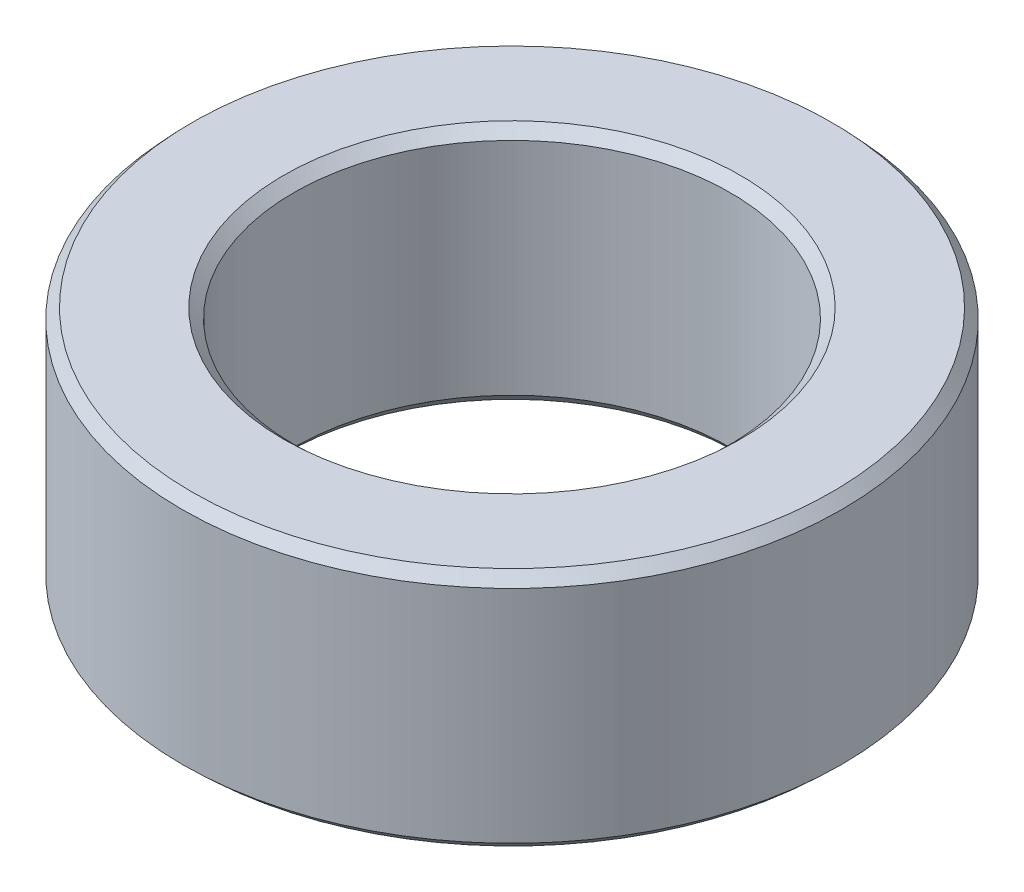
ISO-10303-21;
HEADER;
FILE_DESCRIPTION(('STEP AP214'),'2;1');
FILE_NAME('part.step','',(''),(''),'','','');
FILE_SCHEMA(('AUTOMOTIVE_DESIGN { 1 0 10303 214 1 1 1 1 }'));
ENDSEC;
DATA;
#1=APPLICATION_CONTEXT('core data for automotive mechanical design processes');
#2=APPLICATION_PROTOCOL_DEFINITION('international standard','automotive_design',2000,#1);
#3=PRODUCT_CONTEXT('',#1,'mechanical');
#4=PRODUCT('Part','Part','',(#3));
#5=PRODUCT_RELATED_PRODUCT_CATEGORY('part','',(#4));
#6=PRODUCT_DEFINITION_FORMATION('','',#4);
#7=PRODUCT_DEFINITION_CONTEXT('part definition',#1,'design');
#8=PRODUCT_DEFINITION('design','',#6,#7);
#9=PRODUCT_DEFINITION_SHAPE('','',#8);
#10=(LENGTH_UNIT() NAMED_UNIT(*) SI_UNIT(.MILLI.,.METRE.));
#11=(NAMED_UNIT(*) PLANE_ANGLE_UNIT() SI_UNIT($,.RADIAN.));
#12=(NAMED_UNIT(*) SI_UNIT($,.STERADIAN.) SOLID_ANGLE_UNIT());
#13=UNCERTAINTY_MEASURE_WITH_UNIT(LENGTH_MEASURE(1.E-05),#10,'distance_accuracy_value','');
#14=(GEOMETRIC_REPRESENTATION_CONTEXT(3) GLOBAL_UNCERTAINTY_ASSIGNED_CONTEXT((#13)) GLOBAL_UNIT_ASSIGNED_CONTEXT((#10,
#11,#12)) REPRESENTATION_CONTEXT('',''));
#15=CARTESIAN_POINT('',(0.,0.,0.));
#16=DIRECTION('',(0.,0.,1.));
#17=DIRECTION('',(1.,0.,0.));
#18=AXIS2_PLACEMENT_3D('',#15,#16,#17);
#19=CARTESIAN_POINT('',(0.,40.1695346248338,0.));
#20=DIRECTION('',(0.,-1.,0.));
#21=DIRECTION('',(0.,0.,-1.));
#22=AXIS2_PLACEMENT_3D('',#19,#20,#21);
#23=CYLINDRICAL_SURFACE('',#22,55.);
#24=CARTESIAN_POINT('',(0.,1.61683963421865,0.));
#25=DIRECTION('',(0.,1.,0.));
#26=DIRECTION('',(0.,0.,1.));
#27=AXIS2_PLACEMENT_3D('',#24,#25,#26);
#28=CIRCLE('',#27,55.);
#29=CARTESIAN_POINT('',(0.,1.61683963421865,55.));
#30=VERTEX_POINT('',#29);
#31=EDGE_CURVE('E10',#30,#30,#28,.T.);
#32=ORIENTED_EDGE('',*,*,#31,.T.);
#33=EDGE_LOOP('',(#32));
#34=FACE_BOUND('',#33,.T.);
#35=CARTESIAN_POINT('',(0.,38.4365688196806,0.));
#36=DIRECTION('',(0.,1.,0.));
#37=DIRECTION('',(0.,0.,1.));
#38=AXIS2_PLACEMENT_3D('',#35,#36,#37);
#39=CIRCLE('',#38,55.);
#40=CARTESIAN_POINT('',(0.,38.4365688196806,55.));
#41=VERTEX_POINT('',#40);
#42=EDGE_CURVE('E50',#41,#41,#39,.F.);
#43=ORIENTED_EDGE('',*,*,#42,.T.);
#44=EDGE_LOOP('',(#43));
#45=FACE_BOUND('',#44,.T.);
#46=ADVANCED_FACE('F39',(#34,#45),#23,.T.);
#47=CARTESIAN_POINT('',(0.,40.1695346248338,0.));
#48=DIRECTION('',(0.,1.,0.));
#49=DIRECTION('',(0.,0.,1.));
#50=AXIS2_PLACEMENT_3D('',#47,#48,#49);
#51=PLANE('',#50);
#52=CARTESIAN_POINT('',(0.,40.1695346248338,0.));
#53=DIRECTION('',(0.,1.,0.));
#54=DIRECTION('',(0.,0.,1.));
#55=AXIS2_PLACEMENT_3D('',#52,#53,#54);
#56=CIRCLE('',#55,38.1227693825347);
#57=CARTESIAN_POINT('',(0.,40.1695346248338,38.1227693825347));
#58=VERTEX_POINT('',#57);
#59=EDGE_CURVE('E58',#58,#58,#56,.F.);
#60=ORIENTED_EDGE('',*,*,#59,.T.);
#61=EDGE_LOOP('',(#60));
#62=FACE_BOUND('',#61,.T.);
#63=CARTESIAN_POINT('',(0.,40.1695346248338,0.));
#64=DIRECTION('',(0.,1.,0.));
#65=DIRECTION('',(0.,0.,1.));
#66=AXIS2_PLACEMENT_3D('',#63,#64,#65);
#67=CIRCLE('',#66,53.3831603657814);
#68=CARTESIAN_POINT('',(0.,40.1695346248338,53.3831603657814));
#69=VERTEX_POINT('',#68);
#70=EDGE_CURVE('E61',#69,#69,#67,.T.);
#71=ORIENTED_EDGE('',*,*,#70,.T.);
#72=EDGE_LOOP('',(#71));
#73=FACE_BOUND('',#72,.T.);
#74=ADVANCED_FACE('F88',(#62,#73),#51,.T.);
#75=CARTESIAN_POINT('',(0.,0.,0.));
#76=DIRECTION('',(0.,1.,0.));
#77=DIRECTION('',(0.,0.,1.));
#78=AXIS2_PLACEMENT_3D('',#75,#76,#77);
#79=PLANE('',#78);
#80=CARTESIAN_POINT('',(0.,0.,0.));
#81=DIRECTION('',(0.,1.,0.));
#82=DIRECTION('',(0.,0.,1.));
#83=AXIS2_PLACEMENT_3D('',#80,#81,#82);
#84=CIRCLE('',#83,38.0066432116001);
#85=CARTESIAN_POINT('',(0.,0.,38.0066432116001));
#86=VERTEX_POINT('',#85);
#87=EDGE_CURVE('E51',#86,#86,#84,.T.);
#88=ORIENTED_EDGE('',*,*,#87,.T.);
#89=EDGE_LOOP('',(#88));
#90=FACE_BOUND('',#89,.T.);
#91=CARTESIAN_POINT('',(0.,0.,0.));
#92=DIRECTION('',(0.,1.,0.));
#93=DIRECTION('',(0.,0.,1.));
#94=AXIS2_PLACEMENT_3D('',#91,#92,#93);
#95=CIRCLE('',#94,53.2670341948468);
#96=CARTESIAN_POINT('',(0.,0.,53.2670341948468));
#97=VERTEX_POINT('',#96);
#98=EDGE_CURVE('E54',#97,#97,#95,.F.);
#99=ORIENTED_EDGE('',*,*,#98,.T.);
#100=EDGE_LOOP('',(#99));
#101=FACE_BOUND('',#100,.T.);
#102=ADVANCED_FACE('F83',(#90,#101),#79,.F.);
#103=CARTESIAN_POINT('',(0.,40.1695346248338,0.));
#104=DIRECTION('',(0.,-1.,0.));
#105=DIRECTION('',(0.,0.,-1.));
#106=AXIS2_PLACEMENT_3D('',#103,#104,#105);
#107=CYLINDRICAL_SURFACE('',#106,36.3898035773815);
#108=CARTESIAN_POINT('',(0.,38.5526949906151,0.));
#109=DIRECTION('',(0.,1.,0.));
#110=DIRECTION('',(0.,0.,1.));
#111=AXIS2_PLACEMENT_3D('',#108,#109,#110);
#112=CIRCLE('',#111,36.3898035773815);
#113=CARTESIAN_POINT('',(0.,38.5526949906151,36.3898035773815));
#114=VERTEX_POINT('',#113);
#115=EDGE_CURVE('E67',#114,#114,#112,.T.);
#116=ORIENTED_EDGE('',*,*,#115,.T.);
#117=EDGE_LOOP('',(#116));
#118=FACE_BOUND('',#117,.T.);
#119=CARTESIAN_POINT('',(0.,1.73296580515323,0.));
#120=DIRECTION('',(0.,1.,0.));
#121=DIRECTION('',(0.,0.,1.));
#122=AXIS2_PLACEMENT_3D('',#119,#120,#121);
#123=CIRCLE('',#122,36.3898035773815);
#124=CARTESIAN_POINT('',(0.,1.73296580515323,36.3898035773815));
#125=VERTEX_POINT('',#124);
#126=EDGE_CURVE('E69',#125,#125,#123,.F.);
#127=ORIENTED_EDGE('',*,*,#126,.T.);
#128=EDGE_LOOP('',(#127));
#129=FACE_BOUND('',#128,.T.);
#130=ADVANCED_FACE('F71',(#118,#129),#107,.F.);
#131=CARTESIAN_POINT('',(0.,38.5526949906151,0.));
#132=DIRECTION('',(0.,1.,0.));
#133=DIRECTION('',(0.,0.,1.));
#134=AXIS2_PLACEMENT_3D('',#131,#132,#133);
#135=CONICAL_SURFACE('',#134,36.3898035773815,0.820050828335901);
#136=ORIENTED_EDGE('',*,*,#59,.F.);
#137=EDGE_LOOP('',(#136));
#138=FACE_BOUND('',#137,.T.);
#139=ORIENTED_EDGE('',*,*,#115,.F.);
#140=EDGE_LOOP('',(#139));
#141=FACE_BOUND('',#140,.T.);
#142=ADVANCED_FACE('F77',(#138,#141),#135,.F.);
#143=CARTESIAN_POINT('',(0.,0.,0.));
#144=DIRECTION('',(0.,-1.,0.));
#145=DIRECTION('',(0.,0.,-1.));
#146=AXIS2_PLACEMENT_3D('',#143,#144,#145);
#147=CONICAL_SURFACE('',#146,38.0066432116001,0.750745498458996);
#148=ORIENTED_EDGE('',*,*,#126,.F.);
#149=EDGE_LOOP('',(#148));
#150=FACE_BOUND('',#149,.T.);
#151=ORIENTED_EDGE('',*,*,#87,.F.);
#152=EDGE_LOOP('',(#151));
#153=FACE_BOUND('',#152,.T.);
#154=ADVANCED_FACE('F73',(#150,#153),#147,.F.);
#155=CARTESIAN_POINT('',(0.,1.61683963421865,0.));
#156=DIRECTION('',(0.,1.,0.));
#157=DIRECTION('',(0.,0.,1.));
#158=AXIS2_PLACEMENT_3D('',#155,#156,#157);
#159=CONICAL_SURFACE('',#158,55.,0.8200508283359);
#160=ORIENTED_EDGE('',*,*,#98,.F.);
#161=EDGE_LOOP('',(#160));
#162=FACE_BOUND('',#161,.T.);
#163=ORIENTED_EDGE('',*,*,#31,.F.);
#164=EDGE_LOOP('',(#163));
#165=FACE_BOUND('',#164,.T.);
#166=ADVANCED_FACE('F76',(#162,#165),#159,.T.);
#167=CARTESIAN_POINT('',(0.,40.1695346248338,0.));
#168=DIRECTION('',(0.,-1.,0.));
#169=DIRECTION('',(0.,0.,-1.));
#170=AXIS2_PLACEMENT_3D('',#167,#168,#169);
#171=CONICAL_SURFACE('',#170,53.3831603657814,0.750745498459);
#172=ORIENTED_EDGE('',*,*,#42,.F.);
#173=EDGE_LOOP('',(#172));
#174=FACE_BOUND('',#173,.T.);
#175=ORIENTED_EDGE('',*,*,#70,.F.);
#176=EDGE_LOOP('',(#175));
#177=FACE_BOUND('',#176,.T.);
#178=ADVANCED_FACE('F45',(#174,#177),#171,.T.);
#179=CLOSED_SHELL('',(#46,#74,#102,#130,#142,#154,#166,#178));
#180=MANIFOLD_SOLID_BREP('B2',#179);
#181=ADVANCED_BREP_SHAPE_REPRESENTATION('',(#18,#180),#14);
#182=SHAPE_DEFINITION_REPRESENTATION(#9,#181);
ENDSEC;
END-ISO-10303-21;
